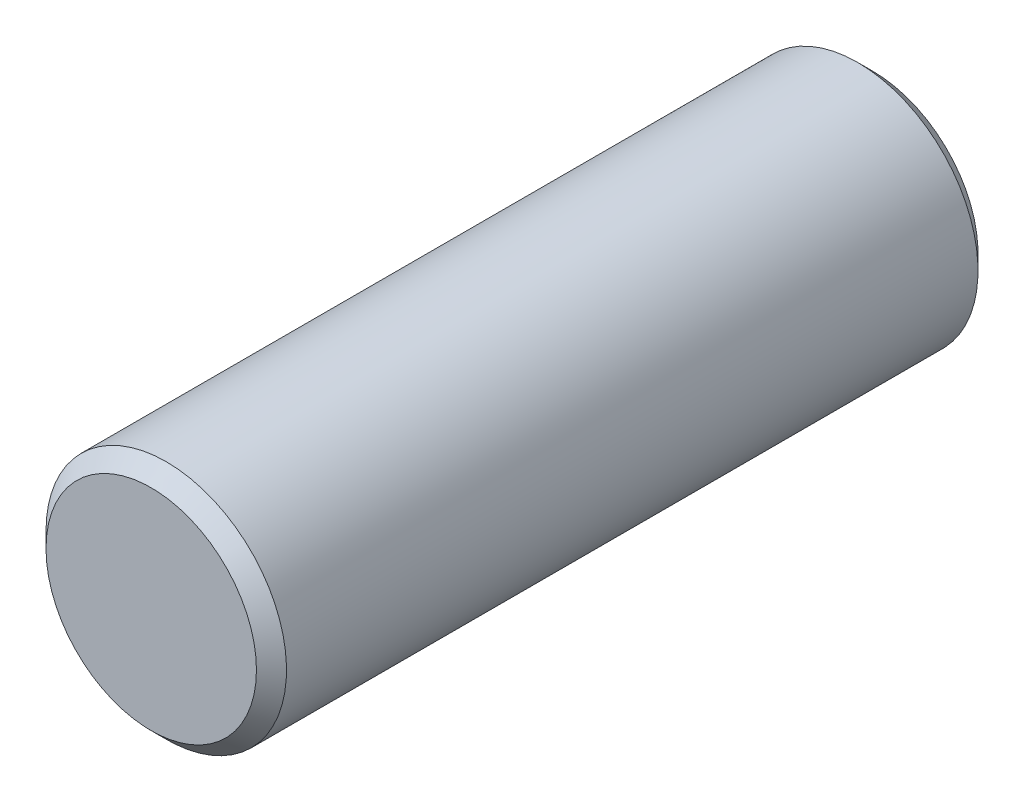
ISO-10303-21;
HEADER;
FILE_DESCRIPTION(('STEP AP214'),'2;1');
FILE_NAME('part.step','',(''),(''),'','','');
FILE_SCHEMA(('AUTOMOTIVE_DESIGN { 1 0 10303 214 1 1 1 1 }'));
ENDSEC;
DATA;
#1=APPLICATION_CONTEXT('core data for automotive mechanical design processes');
#2=APPLICATION_PROTOCOL_DEFINITION('international standard','automotive_design',2000,#1);
#3=PRODUCT_CONTEXT('',#1,'mechanical');
#4=PRODUCT('Part','Part','',(#3));
#5=PRODUCT_RELATED_PRODUCT_CATEGORY('part','',(#4));
#6=PRODUCT_DEFINITION_FORMATION('','',#4);
#7=PRODUCT_DEFINITION_CONTEXT('part definition',#1,'design');
#8=PRODUCT_DEFINITION('design','',#6,#7);
#9=PRODUCT_DEFINITION_SHAPE('','',#8);
#10=(LENGTH_UNIT() NAMED_UNIT(*) SI_UNIT(.MILLI.,.METRE.));
#11=(NAMED_UNIT(*) PLANE_ANGLE_UNIT() SI_UNIT($,.RADIAN.));
#12=(NAMED_UNIT(*) SI_UNIT($,.STERADIAN.) SOLID_ANGLE_UNIT());
#13=UNCERTAINTY_MEASURE_WITH_UNIT(LENGTH_MEASURE(1.E-05),#10,'distance_accuracy_value','');
#14=(GEOMETRIC_REPRESENTATION_CONTEXT(3) GLOBAL_UNCERTAINTY_ASSIGNED_CONTEXT((#13)) GLOBAL_UNIT_ASSIGNED_CONTEXT((#10,
#11,#12)) REPRESENTATION_CONTEXT('',''));
#15=CARTESIAN_POINT('',(0.,0.,0.));
#16=DIRECTION('',(0.,0.,1.));
#17=DIRECTION('',(1.,0.,0.));
#18=AXIS2_PLACEMENT_3D('',#15,#16,#17);
#19=CARTESIAN_POINT('',(0.,0.,5.99999999999999));
#20=DIRECTION('',(0.,0.,1.));
#21=DIRECTION('',(0.,-1.,0.));
#22=AXIS2_PLACEMENT_3D('',#19,#20,#21);
#23=PLANE('',#22);
#24=CARTESIAN_POINT('',(0.,0.,6.00000000002865));
#25=DIRECTION('',(0.,0.,-1.));
#26=DIRECTION('',(-1.,0.,0.));
#27=AXIS2_PLACEMENT_3D('',#24,#25,#26);
#28=CIRCLE('',#27,1.74999999995862);
#29=CARTESIAN_POINT('',(-1.74999999995862,0.,6.00000000002865));
#30=VERTEX_POINT('',#29);
#31=EDGE_CURVE('E18',#30,#30,#28,.T.);
#32=ORIENTED_EDGE('',*,*,#31,.F.);
#33=EDGE_LOOP('',(#32));
#34=FACE_BOUND('',#33,.T.);
#35=ADVANCED_FACE('F15',(#34),#23,.T.);
#36=CARTESIAN_POINT('',(0.,0.,-6.));
#37=DIRECTION('',(0.,0.,1.));
#38=DIRECTION('',(0.,-1.,0.));
#39=AXIS2_PLACEMENT_3D('',#36,#37,#38);
#40=PLANE('',#39);
#41=CARTESIAN_POINT('',(0.,0.,-6.00000000002865));
#42=DIRECTION('',(0.,0.,1.));
#43=DIRECTION('',(0.,-1.,0.));
#44=AXIS2_PLACEMENT_3D('',#41,#42,#43);
#45=CIRCLE('',#44,1.75000000001546);
#46=CARTESIAN_POINT('',(0.,-1.75000000001546,-6.00000000002865));
#47=VERTEX_POINT('',#46);
#48=EDGE_CURVE('E27',#47,#47,#45,.T.);
#49=ORIENTED_EDGE('',*,*,#48,.F.);
#50=EDGE_LOOP('',(#49));
#51=FACE_BOUND('',#50,.T.);
#52=ADVANCED_FACE('F38',(#51),#40,.F.);
#53=CARTESIAN_POINT('',(0.,0.,5.75000000003456));
#54=DIRECTION('',(0.,0.,-1.));
#55=DIRECTION('',(-1.,0.,0.));
#56=AXIS2_PLACEMENT_3D('',#53,#54,#55);
#57=CONICAL_SURFACE('',#56,1.99999999995271,0.785398163397448);
#58=CARTESIAN_POINT('',(0.,0.,5.74999999999999));
#59=DIRECTION('',(0.,0.,-1.));
#60=DIRECTION('',(0.,1.,0.));
#61=AXIS2_PLACEMENT_3D('',#58,#59,#60);
#62=CIRCLE('',#61,2.);
#63=CARTESIAN_POINT('',(0.,2.,5.74999999999999));
#64=VERTEX_POINT('',#63);
#65=EDGE_CURVE('E22',#64,#64,#62,.T.);
#66=ORIENTED_EDGE('',*,*,#65,.F.);
#67=EDGE_LOOP('',(#66));
#68=FACE_BOUND('',#67,.T.);
#69=ORIENTED_EDGE('',*,*,#31,.T.);
#70=EDGE_LOOP('',(#69));
#71=FACE_BOUND('',#70,.T.);
#72=ADVANCED_FACE('F35',(#68,#71),#57,.T.);
#73=CARTESIAN_POINT('',(0.,0.,-5.7500000000914));
#74=DIRECTION('',(0.,0.,1.));
#75=DIRECTION('',(0.,-1.,0.));
#76=AXIS2_PLACEMENT_3D('',#73,#74,#75);
#77=CONICAL_SURFACE('',#76,1.99999999989586,0.785398163283761);
#78=CARTESIAN_POINT('',(0.,0.,-5.75));
#79=DIRECTION('',(0.,0.,-1.));
#80=DIRECTION('',(0.,1.,0.));
#81=AXIS2_PLACEMENT_3D('',#78,#79,#80);
#82=CIRCLE('',#81,2.);
#83=CARTESIAN_POINT('',(0.,2.,-5.75));
#84=VERTEX_POINT('',#83);
#85=EDGE_CURVE('E10',#84,#84,#82,.F.);
#86=ORIENTED_EDGE('',*,*,#85,.F.);
#87=EDGE_LOOP('',(#86));
#88=FACE_BOUND('',#87,.T.);
#89=ORIENTED_EDGE('',*,*,#48,.T.);
#90=EDGE_LOOP('',(#89));
#91=FACE_BOUND('',#90,.T.);
#92=ADVANCED_FACE('F46',(#88,#91),#77,.T.);
#93=CARTESIAN_POINT('',(0.,0.,5.99999999999999));
#94=DIRECTION('',(0.,0.,-1.));
#95=DIRECTION('',(0.,1.,0.));
#96=AXIS2_PLACEMENT_3D('',#93,#94,#95);
#97=CYLINDRICAL_SURFACE('',#96,2.);
#98=ORIENTED_EDGE('',*,*,#85,.T.);
#99=EDGE_LOOP('',(#98));
#100=FACE_BOUND('',#99,.T.);
#101=ORIENTED_EDGE('',*,*,#65,.T.);
#102=EDGE_LOOP('',(#101));
#103=FACE_BOUND('',#102,.T.);
#104=ADVANCED_FACE('F44',(#100,#103),#97,.T.);
#105=CLOSED_SHELL('',(#35,#52,#72,#92,#104));
#106=MANIFOLD_SOLID_BREP('B1',#105);
#107=ADVANCED_BREP_SHAPE_REPRESENTATION('',(#18,#106),#14);
#108=SHAPE_DEFINITION_REPRESENTATION(#9,#107);
ENDSEC;
END-ISO-10303-21;
